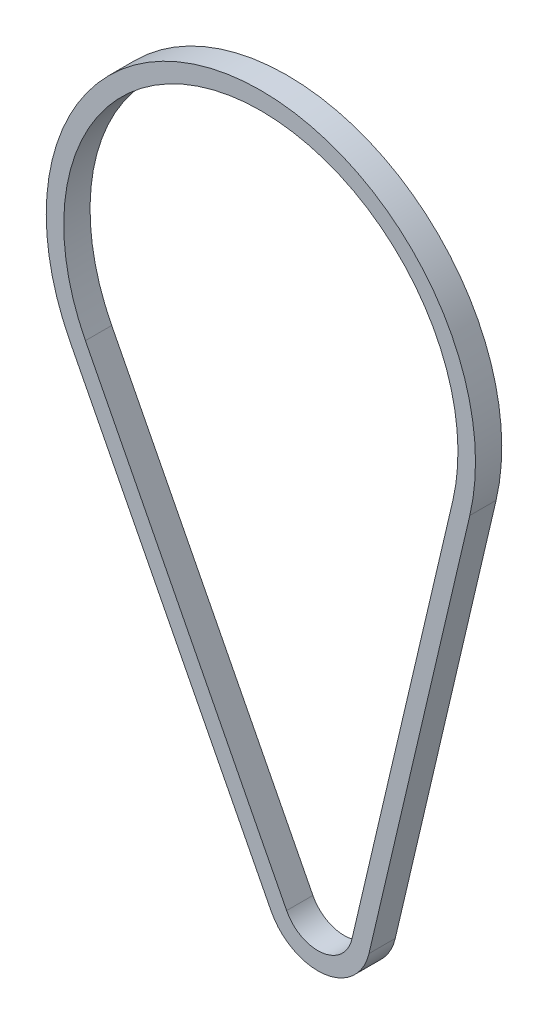
ISO-10303-21;
HEADER;
FILE_DESCRIPTION(('STEP AP214'),'2;1');
FILE_NAME('part.step','',(''),(''),'','','');
FILE_SCHEMA(('AUTOMOTIVE_DESIGN { 1 0 10303 214 1 1 1 1 }'));
ENDSEC;
DATA;
#1=APPLICATION_CONTEXT('core data for automotive mechanical design processes');
#2=APPLICATION_PROTOCOL_DEFINITION('international standard','automotive_design',2000,#1);
#3=PRODUCT_CONTEXT('',#1,'mechanical');
#4=PRODUCT('Part','Part','',(#3));
#5=PRODUCT_RELATED_PRODUCT_CATEGORY('part','',(#4));
#6=PRODUCT_DEFINITION_FORMATION('','',#4);
#7=PRODUCT_DEFINITION_CONTEXT('part definition',#1,'design');
#8=PRODUCT_DEFINITION('design','',#6,#7);
#9=PRODUCT_DEFINITION_SHAPE('','',#8);
#10=(LENGTH_UNIT() NAMED_UNIT(*) SI_UNIT(.MILLI.,.METRE.));
#11=(NAMED_UNIT(*) PLANE_ANGLE_UNIT() SI_UNIT($,.RADIAN.));
#12=(NAMED_UNIT(*) SI_UNIT($,.STERADIAN.) SOLID_ANGLE_UNIT());
#13=UNCERTAINTY_MEASURE_WITH_UNIT(LENGTH_MEASURE(1.E-05),#10,'distance_accuracy_value','');
#14=(GEOMETRIC_REPRESENTATION_CONTEXT(3) GLOBAL_UNCERTAINTY_ASSIGNED_CONTEXT((#13)) GLOBAL_UNIT_ASSIGNED_CONTEXT((#10,
#11,#12)) REPRESENTATION_CONTEXT('',''));
#15=CARTESIAN_POINT('',(0.,0.,0.));
#16=DIRECTION('',(0.,0.,1.));
#17=DIRECTION('',(1.,0.,0.));
#18=AXIS2_PLACEMENT_3D('',#15,#16,#17);
#19=CARTESIAN_POINT('',(0.,0.,7.5));
#20=DIRECTION('',(0.,0.,-1.));
#21=DIRECTION('',(-1.,0.,0.));
#22=AXIS2_PLACEMENT_3D('',#19,#20,#21);
#23=PLANE('',#22);
#24=CARTESIAN_POINT('',(0.,0.,7.5));
#25=DIRECTION('',(0.,0.,-1.));
#26=DIRECTION('',(-1.,0.,0.));
#27=AXIS2_PLACEMENT_3D('',#24,#25,#26);
#28=CIRCLE('',#27,30.);
#29=CARTESIAN_POINT('',(-26.7036884017681,-13.6716138674728,7.49999999999999));
#30=VERTEX_POINT('',#29);
#31=CARTESIAN_POINT('',(29.2070012744006,-6.85208556259781,7.5));
#32=VERTEX_POINT('',#31);
#33=EDGE_CURVE('E159',#30,#32,#28,.F.);
#34=ORIENTED_EDGE('',*,*,#33,.T.);
#35=DIRECTION('',(0.228402852086592,0.973566709146687,0.));
#36=VECTOR('',#35,1.);
#37=CARTESIAN_POINT('',(29.2070012744006,-6.85208556259777,7.5));
#38=LINE('',#37,#36);
#39=CARTESIAN_POINT('',(86.7619218704695,238.475650619392,7.5));
#40=VERTEX_POINT('',#39);
#41=EDGE_CURVE('E162',#32,#40,#38,.T.);
#42=ORIENTED_EDGE('',*,*,#41,.T.);
#43=CARTESIAN_POINT('',(-32.4999999999998,266.455,7.5));
#44=DIRECTION('',(0.,0.,-1.));
#45=DIRECTION('',(-1.,0.,0.));
#46=AXIS2_PLACEMENT_3D('',#43,#44,#45);
#47=CIRCLE('',#46,122.5);
#48=CARTESIAN_POINT('',(-141.540060973886,210.629243374486,7.5));
#49=VERTEX_POINT('',#48);
#50=EDGE_CURVE('E165',#40,#49,#47,.F.);
#51=ORIENTED_EDGE('',*,*,#50,.T.);
#52=DIRECTION('',(0.455720462249092,-0.890122946725605,0.));
#53=VECTOR('',#52,1.);
#54=CARTESIAN_POINT('',(-26.7036884017681,-13.6716138674728,7.5));
#55=LINE('',#54,#53);
#56=EDGE_CURVE('E167',#49,#30,#55,.T.);
#57=ORIENTED_EDGE('',*,*,#56,.T.);
#58=EDGE_LOOP('',(#34,#42,#51,#57));
#59=FACE_BOUND('',#58,.T.);
#60=CARTESIAN_POINT('',(0.,0.,7.5));
#61=DIRECTION('',(0.,0.,1.));
#62=DIRECTION('',(-1.,0.,0.));
#63=AXIS2_PLACEMENT_3D('',#60,#61,#62);
#64=CIRCLE('',#63,20.);
#65=CARTESIAN_POINT('',(-17.8024589345121,-9.11440924498185,7.5));
#66=VERTEX_POINT('',#65);
#67=CARTESIAN_POINT('',(19.4713341829337,-4.56805704173185,7.5));
#68=VERTEX_POINT('',#67);
#69=EDGE_CURVE('E123',#66,#68,#64,.T.);
#70=ORIENTED_EDGE('',*,*,#69,.F.);
#71=DIRECTION('',(0.455720462249092,-0.890122946725605,0.));
#72=VECTOR('',#71,1.);
#73=CARTESIAN_POINT('',(-17.8024589345121,-9.11440924498185,7.5));
#74=LINE('',#73,#72);
#75=CARTESIAN_POINT('',(-132.63883150663,215.186447996977,7.5));
#76=VERTEX_POINT('',#75);
#77=EDGE_CURVE('E145',#76,#66,#74,.T.);
#78=ORIENTED_EDGE('',*,*,#77,.F.);
#79=CARTESIAN_POINT('',(-32.4999999999998,266.455,7.5));
#80=DIRECTION('',(0.,0.,1.));
#81=DIRECTION('',(-1.,0.,0.));
#82=AXIS2_PLACEMENT_3D('',#79,#80,#81);
#83=CIRCLE('',#82,112.5);
#84=CARTESIAN_POINT('',(77.0262547790026,240.759679140258,7.5));
#85=VERTEX_POINT('',#84);
#86=EDGE_CURVE('E143',#85,#76,#83,.T.);
#87=ORIENTED_EDGE('',*,*,#86,.F.);
#88=DIRECTION('',(0.228402852086592,0.973566709146687,0.));
#89=VECTOR('',#88,1.);
#90=CARTESIAN_POINT('',(77.0262547790026,240.759679140258,7.5));
#91=LINE('',#90,#89);
#92=EDGE_CURVE('E131',#68,#85,#91,.T.);
#93=ORIENTED_EDGE('',*,*,#92,.F.);
#94=EDGE_LOOP('',(#70,#78,#87,#93));
#95=FACE_BOUND('',#94,.T.);
#96=ADVANCED_FACE('F58',(#59,#95),#23,.F.);
#97=CARTESIAN_POINT('',(0.,0.,-7.5));
#98=DIRECTION('',(0.,0.,-1.));
#99=DIRECTION('',(-1.,0.,0.));
#100=AXIS2_PLACEMENT_3D('',#97,#98,#99);
#101=PLANE('',#100);
#102=CARTESIAN_POINT('',(0.,0.,-7.5));
#103=DIRECTION('',(0.,0.,-1.));
#104=DIRECTION('',(-1.,0.,0.));
#105=AXIS2_PLACEMENT_3D('',#102,#103,#104);
#106=CIRCLE('',#105,30.);
#107=CARTESIAN_POINT('',(-26.7036884017681,-13.6716138674728,-7.50000000000001));
#108=VERTEX_POINT('',#107);
#109=CARTESIAN_POINT('',(29.2070012744006,-6.85208556259781,-7.5));
#110=VERTEX_POINT('',#109);
#111=EDGE_CURVE('E139',#108,#110,#106,.F.);
#112=ORIENTED_EDGE('',*,*,#111,.F.);
#113=DIRECTION('',(0.455720462249092,-0.890122946725605,0.));
#114=VECTOR('',#113,1.);
#115=CARTESIAN_POINT('',(-26.7036884017681,-13.6716138674728,-7.5));
#116=LINE('',#115,#114);
#117=CARTESIAN_POINT('',(-141.540060973886,210.629243374486,-7.5));
#118=VERTEX_POINT('',#117);
#119=EDGE_CURVE('E163',#118,#108,#116,.T.);
#120=ORIENTED_EDGE('',*,*,#119,.F.);
#121=CARTESIAN_POINT('',(-32.4999999999998,266.455,-7.5));
#122=DIRECTION('',(0.,0.,-1.));
#123=DIRECTION('',(-1.,0.,0.));
#124=AXIS2_PLACEMENT_3D('',#121,#122,#123);
#125=CIRCLE('',#124,122.5);
#126=CARTESIAN_POINT('',(86.7619218704695,238.475650619392,-7.5));
#127=VERTEX_POINT('',#126);
#128=EDGE_CURVE('E174',#127,#118,#125,.F.);
#129=ORIENTED_EDGE('',*,*,#128,.F.);
#130=DIRECTION('',(0.228402852086592,0.973566709146687,0.));
#131=VECTOR('',#130,1.);
#132=CARTESIAN_POINT('',(29.2070012744006,-6.85208556259777,-7.5));
#133=LINE('',#132,#131);
#134=EDGE_CURVE('E172',#110,#127,#133,.T.);
#135=ORIENTED_EDGE('',*,*,#134,.F.);
#136=EDGE_LOOP('',(#112,#120,#129,#135));
#137=FACE_BOUND('',#136,.T.);
#138=DIRECTION('',(0.455720462249092,-0.890122946725605,0.));
#139=VECTOR('',#138,1.);
#140=CARTESIAN_POINT('',(-17.8024589345121,-9.11440924498185,-7.5));
#141=LINE('',#140,#139);
#142=CARTESIAN_POINT('',(-132.63883150663,215.186447996977,-7.5));
#143=VERTEX_POINT('',#142);
#144=CARTESIAN_POINT('',(-17.8024589345121,-9.11440924498185,-7.5));
#145=VERTEX_POINT('',#144);
#146=EDGE_CURVE('E132',#143,#145,#141,.T.);
#147=ORIENTED_EDGE('',*,*,#146,.T.);
#148=CARTESIAN_POINT('',(0.,0.,-7.5));
#149=DIRECTION('',(0.,0.,1.));
#150=DIRECTION('',(-1.,0.,0.));
#151=AXIS2_PLACEMENT_3D('',#148,#149,#150);
#152=CIRCLE('',#151,20.);
#153=CARTESIAN_POINT('',(19.4713341829337,-4.56805704173185,-7.5));
#154=VERTEX_POINT('',#153);
#155=EDGE_CURVE('E81',#145,#154,#152,.T.);
#156=ORIENTED_EDGE('',*,*,#155,.T.);
#157=DIRECTION('',(0.228402852086592,0.973566709146687,0.));
#158=VECTOR('',#157,1.);
#159=CARTESIAN_POINT('',(77.0262547790026,240.759679140258,-7.5));
#160=LINE('',#159,#158);
#161=CARTESIAN_POINT('',(77.0262547790026,240.759679140258,-7.5));
#162=VERTEX_POINT('',#161);
#163=EDGE_CURVE('E138',#154,#162,#160,.T.);
#164=ORIENTED_EDGE('',*,*,#163,.T.);
#165=CARTESIAN_POINT('',(-32.4999999999998,266.455,-7.5));
#166=DIRECTION('',(0.,0.,1.));
#167=DIRECTION('',(-1.,0.,0.));
#168=AXIS2_PLACEMENT_3D('',#165,#166,#167);
#169=CIRCLE('',#168,112.5);
#170=EDGE_CURVE('E151',#162,#143,#169,.T.);
#171=ORIENTED_EDGE('',*,*,#170,.T.);
#172=EDGE_LOOP('',(#147,#156,#164,#171));
#173=FACE_BOUND('',#172,.T.);
#174=ADVANCED_FACE('F192',(#137,#173),#101,.T.);
#175=CARTESIAN_POINT('',(0.,0.,7.5));
#176=DIRECTION('',(0.,0.,-1.));
#177=DIRECTION('',(-1.,0.,0.));
#178=AXIS2_PLACEMENT_3D('',#175,#176,#177);
#179=CYLINDRICAL_SURFACE('',#178,30.);
#180=ORIENTED_EDGE('',*,*,#111,.T.);
#181=DIRECTION('',(0.,0.,-1.));
#182=VECTOR('',#181,1.);
#183=CARTESIAN_POINT('',(29.2070012744006,-6.85208556259781,7.5));
#184=LINE('',#183,#182);
#185=EDGE_CURVE('E12',#32,#110,#184,.T.);
#186=ORIENTED_EDGE('',*,*,#185,.F.);
#187=ORIENTED_EDGE('',*,*,#33,.F.);
#188=DIRECTION('',(0.,0.,-1.));
#189=VECTOR('',#188,1.);
#190=CARTESIAN_POINT('',(-26.7036884017681,-13.6716138674728,7.49999999999999));
#191=LINE('',#190,#189);
#192=EDGE_CURVE('E169',#30,#108,#191,.T.);
#193=ORIENTED_EDGE('',*,*,#192,.T.);
#194=EDGE_LOOP('',(#180,#186,#187,#193));
#195=FACE_BOUND('',#194,.T.);
#196=ADVANCED_FACE('F60',(#195),#179,.T.);
#197=CARTESIAN_POINT('',(29.2070012744006,-6.85208556259777,7.5));
#198=DIRECTION('',(-0.973566709146687,0.228402852086592,0.));
#199=DIRECTION('',(-0.228402852086592,-0.973566709146687,0.));
#200=AXIS2_PLACEMENT_3D('',#197,#198,#199);
#201=PLANE('',#200);
#202=ORIENTED_EDGE('',*,*,#134,.T.);
#203=DIRECTION('',(0.,0.,-1.));
#204=VECTOR('',#203,1.);
#205=CARTESIAN_POINT('',(86.7619218704695,238.475650619392,7.5));
#206=LINE('',#205,#204);
#207=EDGE_CURVE('E66',#40,#127,#206,.T.);
#208=ORIENTED_EDGE('',*,*,#207,.F.);
#209=ORIENTED_EDGE('',*,*,#41,.F.);
#210=ORIENTED_EDGE('',*,*,#185,.T.);
#211=EDGE_LOOP('',(#202,#208,#209,#210));
#212=FACE_BOUND('',#211,.T.);
#213=ADVANCED_FACE('F202',(#212),#201,.F.);
#214=CARTESIAN_POINT('',(-32.4999999999998,266.455,7.5));
#215=DIRECTION('',(0.,0.,-1.));
#216=DIRECTION('',(-1.,0.,0.));
#217=AXIS2_PLACEMENT_3D('',#214,#215,#216);
#218=CYLINDRICAL_SURFACE('',#217,122.5);
#219=ORIENTED_EDGE('',*,*,#128,.T.);
#220=DIRECTION('',(0.,0.,-1.));
#221=VECTOR('',#220,1.);
#222=CARTESIAN_POINT('',(-141.540060973886,210.629243374486,7.5));
#223=LINE('',#222,#221);
#224=EDGE_CURVE('E179',#49,#118,#223,.T.);
#225=ORIENTED_EDGE('',*,*,#224,.F.);
#226=ORIENTED_EDGE('',*,*,#50,.F.);
#227=ORIENTED_EDGE('',*,*,#207,.T.);
#228=EDGE_LOOP('',(#219,#225,#226,#227));
#229=FACE_BOUND('',#228,.T.);
#230=ADVANCED_FACE('F186',(#229),#218,.T.);
#231=CARTESIAN_POINT('',(-26.7036884017681,-13.6716138674728,7.5));
#232=DIRECTION('',(0.890122946725605,0.455720462249092,0.));
#233=DIRECTION('',(-0.455720462249093,0.890122946725605,0.));
#234=AXIS2_PLACEMENT_3D('',#231,#232,#233);
#235=PLANE('',#234);
#236=ORIENTED_EDGE('',*,*,#119,.T.);
#237=ORIENTED_EDGE('',*,*,#192,.F.);
#238=ORIENTED_EDGE('',*,*,#56,.F.);
#239=ORIENTED_EDGE('',*,*,#224,.T.);
#240=EDGE_LOOP('',(#236,#237,#238,#239));
#241=FACE_BOUND('',#240,.T.);
#242=ADVANCED_FACE('F196',(#241),#235,.F.);
#243=CARTESIAN_POINT('',(0.,0.,7.5));
#244=DIRECTION('',(0.,0.,-1.));
#245=DIRECTION('',(-1.,0.,0.));
#246=AXIS2_PLACEMENT_3D('',#243,#244,#245);
#247=CYLINDRICAL_SURFACE('',#246,20.);
#248=ORIENTED_EDGE('',*,*,#155,.F.);
#249=DIRECTION('',(0.,0.,-1.));
#250=VECTOR('',#249,1.);
#251=CARTESIAN_POINT('',(-17.8024589345121,-9.11440924498185,7.5));
#252=LINE('',#251,#250);
#253=EDGE_CURVE('E127',#66,#145,#252,.T.);
#254=ORIENTED_EDGE('',*,*,#253,.F.);
#255=ORIENTED_EDGE('',*,*,#69,.T.);
#256=DIRECTION('',(0.,0.,-1.));
#257=VECTOR('',#256,1.);
#258=CARTESIAN_POINT('',(19.4713341829337,-4.56805704173185,7.5));
#259=LINE('',#258,#257);
#260=EDGE_CURVE('E126',#68,#154,#259,.T.);
#261=ORIENTED_EDGE('',*,*,#260,.T.);
#262=EDGE_LOOP('',(#248,#254,#255,#261));
#263=FACE_BOUND('',#262,.T.);
#264=ADVANCED_FACE('F125',(#263),#247,.F.);
#265=CARTESIAN_POINT('',(77.0262547790026,240.759679140258,7.5));
#266=DIRECTION('',(-0.973566709146687,0.228402852086592,0.));
#267=DIRECTION('',(-0.228402852086592,-0.973566709146687,0.));
#268=AXIS2_PLACEMENT_3D('',#265,#266,#267);
#269=PLANE('',#268);
#270=ORIENTED_EDGE('',*,*,#163,.F.);
#271=ORIENTED_EDGE('',*,*,#260,.F.);
#272=ORIENTED_EDGE('',*,*,#92,.T.);
#273=DIRECTION('',(0.,0.,-1.));
#274=VECTOR('',#273,1.);
#275=CARTESIAN_POINT('',(77.0262547790026,240.759679140258,7.5));
#276=LINE('',#275,#274);
#277=EDGE_CURVE('E140',#85,#162,#276,.T.);
#278=ORIENTED_EDGE('',*,*,#277,.T.);
#279=EDGE_LOOP('',(#270,#271,#272,#278));
#280=FACE_BOUND('',#279,.T.);
#281=ADVANCED_FACE('F135',(#280),#269,.T.);
#282=CARTESIAN_POINT('',(-32.4999999999998,266.455,7.5));
#283=DIRECTION('',(0.,0.,-1.));
#284=DIRECTION('',(-1.,0.,0.));
#285=AXIS2_PLACEMENT_3D('',#282,#283,#284);
#286=CYLINDRICAL_SURFACE('',#285,112.5);
#287=ORIENTED_EDGE('',*,*,#170,.F.);
#288=ORIENTED_EDGE('',*,*,#277,.F.);
#289=ORIENTED_EDGE('',*,*,#86,.T.);
#290=DIRECTION('',(0.,0.,-1.));
#291=VECTOR('',#290,1.);
#292=CARTESIAN_POINT('',(-132.63883150663,215.186447996977,7.5));
#293=LINE('',#292,#291);
#294=EDGE_CURVE('E73',#76,#143,#293,.T.);
#295=ORIENTED_EDGE('',*,*,#294,.T.);
#296=EDGE_LOOP('',(#287,#288,#289,#295));
#297=FACE_BOUND('',#296,.T.);
#298=ADVANCED_FACE('F225',(#297),#286,.F.);
#299=CARTESIAN_POINT('',(-17.8024589345121,-9.11440924498185,7.5));
#300=DIRECTION('',(0.890122946725605,0.455720462249092,0.));
#301=DIRECTION('',(-0.455720462249092,0.890122946725605,0.));
#302=AXIS2_PLACEMENT_3D('',#299,#300,#301);
#303=PLANE('',#302);
#304=ORIENTED_EDGE('',*,*,#146,.F.);
#305=ORIENTED_EDGE('',*,*,#294,.F.);
#306=ORIENTED_EDGE('',*,*,#77,.T.);
#307=ORIENTED_EDGE('',*,*,#253,.T.);
#308=EDGE_LOOP('',(#304,#305,#306,#307));
#309=FACE_BOUND('',#308,.T.);
#310=ADVANCED_FACE('F229',(#309),#303,.T.);
#311=CLOSED_SHELL('',(#96,#174,#196,#213,#230,#242,#264,#281,#298,#310));
#312=MANIFOLD_SOLID_BREP('B2',#311);
#313=ADVANCED_BREP_SHAPE_REPRESENTATION('',(#18,#312),#14);
#314=SHAPE_DEFINITION_REPRESENTATION(#9,#313);
ENDSEC;
END-ISO-10303-21;
